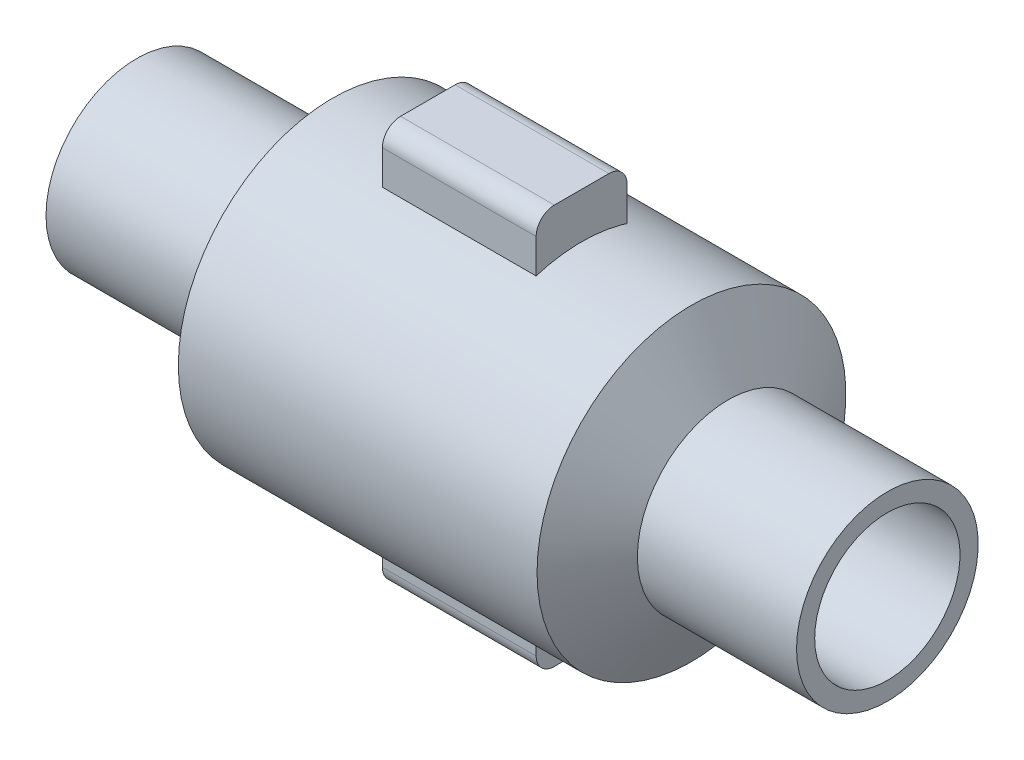
ISO-10303-21;
HEADER;
FILE_DESCRIPTION(('STEP AP214'),'2;1');
FILE_NAME('part.step','',(''),(''),'','','');
FILE_SCHEMA(('AUTOMOTIVE_DESIGN { 1 0 10303 214 1 1 1 1 }'));
ENDSEC;
DATA;
#1=APPLICATION_CONTEXT('core data for automotive mechanical design processes');
#2=APPLICATION_PROTOCOL_DEFINITION('international standard','automotive_design',2000,#1);
#3=PRODUCT_CONTEXT('',#1,'mechanical');
#4=PRODUCT('Part','Part','',(#3));
#5=PRODUCT_RELATED_PRODUCT_CATEGORY('part','',(#4));
#6=PRODUCT_DEFINITION_FORMATION('','',#4);
#7=PRODUCT_DEFINITION_CONTEXT('part definition',#1,'design');
#8=PRODUCT_DEFINITION('design','',#6,#7);
#9=PRODUCT_DEFINITION_SHAPE('','',#8);
#10=(LENGTH_UNIT() NAMED_UNIT(*) SI_UNIT(.MILLI.,.METRE.));
#11=(NAMED_UNIT(*) PLANE_ANGLE_UNIT() SI_UNIT($,.RADIAN.));
#12=(NAMED_UNIT(*) SI_UNIT($,.STERADIAN.) SOLID_ANGLE_UNIT());
#13=UNCERTAINTY_MEASURE_WITH_UNIT(LENGTH_MEASURE(1.E-05),#10,'distance_accuracy_value','');
#14=(GEOMETRIC_REPRESENTATION_CONTEXT(3) GLOBAL_UNCERTAINTY_ASSIGNED_CONTEXT((#13)) GLOBAL_UNIT_ASSIGNED_CONTEXT((#10,
#11,#12)) REPRESENTATION_CONTEXT('',''));
#15=CARTESIAN_POINT('',(0.,0.,0.));
#16=DIRECTION('',(0.,0.,1.));
#17=DIRECTION('',(1.,0.,0.));
#18=AXIS2_PLACEMENT_3D('',#15,#16,#17);
#19=CARTESIAN_POINT('',(979.402861939771,-299.999999958007,-100.093269930531));
#20=DIRECTION('',(1.,0.,0.));
#21=DIRECTION('',(0.,1.,0.));
#22=AXIS2_PLACEMENT_3D('',#19,#20,#21);
#23=PLANE('',#22);
#24=DIRECTION('',(0.,-1.,0.));
#25=VECTOR('',#24,1.);
#26=CARTESIAN_POINT('',(979.402861939771,-299.999999958007,100.093269930531));
#27=LINE('',#26,#25);
#28=CARTESIAN_POINT('',(979.402861939771,-299.999999958007,100.093269930531));
#29=VERTEX_POINT('',#28);
#30=CARTESIAN_POINT('',(979.402861939771,-399.999999856007,100.093269930531));
#31=VERTEX_POINT('',#30);
#32=EDGE_CURVE('E97',#29,#31,#27,.T.);
#33=ORIENTED_EDGE('',*,*,#32,.T.);
#34=CARTESIAN_POINT('',(979.402861939771,-399.999999856007,60.0932699305311));
#35=DIRECTION('',(1.,0.,0.));
#36=DIRECTION('',(0.,1.,0.));
#37=AXIS2_PLACEMENT_3D('',#34,#35,#36);
#38=CIRCLE('',#37,40.);
#39=CARTESIAN_POINT('',(979.40286193977,-439.999999856007,60.0932699305311));
#40=VERTEX_POINT('',#39);
#41=EDGE_CURVE('E54',#31,#40,#38,.T.);
#42=ORIENTED_EDGE('',*,*,#41,.T.);
#43=DIRECTION('',(0.,0.,1.));
#44=VECTOR('',#43,1.);
#45=CARTESIAN_POINT('',(979.40286193977,-439.999999856007,-100.093269930531));
#46=LINE('',#45,#44);
#47=CARTESIAN_POINT('',(979.40286193977,-439.999999856007,-60.0932699305311));
#48=VERTEX_POINT('',#47);
#49=EDGE_CURVE('E120',#48,#40,#46,.T.);
#50=ORIENTED_EDGE('',*,*,#49,.F.);
#51=CARTESIAN_POINT('',(979.402861939771,-399.999999856007,-60.0932699305311));
#52=DIRECTION('',(1.,0.,0.));
#53=DIRECTION('',(0.,1.,0.));
#54=AXIS2_PLACEMENT_3D('',#51,#52,#53);
#55=CIRCLE('',#54,40.);
#56=CARTESIAN_POINT('',(979.402861939771,-399.999999856007,-100.093269930531));
#57=VERTEX_POINT('',#56);
#58=EDGE_CURVE('E61',#48,#57,#55,.T.);
#59=ORIENTED_EDGE('',*,*,#58,.T.);
#60=DIRECTION('',(0.,-1.,0.));
#61=VECTOR('',#60,1.);
#62=CARTESIAN_POINT('',(979.402861939771,-299.999999958007,-100.093269930531));
#63=LINE('',#62,#61);
#64=CARTESIAN_POINT('',(979.402861939771,-299.999999958007,-100.093269930531));
#65=VERTEX_POINT('',#64);
#66=EDGE_CURVE('E116',#65,#57,#63,.T.);
#67=ORIENTED_EDGE('',*,*,#66,.F.);
#68=DIRECTION('',(0.,0.,1.));
#69=VECTOR('',#68,1.);
#70=CARTESIAN_POINT('',(979.402861939771,-299.999999958007,-100.093269930531));
#71=LINE('',#70,#69);
#72=EDGE_CURVE('E111',#65,#29,#71,.T.);
#73=ORIENTED_EDGE('',*,*,#72,.T.);
#74=EDGE_LOOP('',(#33,#42,#50,#59,#67,#73));
#75=FACE_BOUND('',#74,.T.);
#76=ADVANCED_FACE('F46',(#75),#23,.T.);
#77=CARTESIAN_POINT('',(979.402861939771,-299.999999958007,-100.093269930531));
#78=DIRECTION('',(0.,0.,-1.));
#79=DIRECTION('',(-1.,0.,0.));
#80=AXIS2_PLACEMENT_3D('',#77,#78,#79);
#81=PLANE('',#80);
#82=ORIENTED_EDGE('',*,*,#66,.T.);
#83=DIRECTION('',(1.,0.,0.));
#84=VECTOR('',#83,1.);
#85=CARTESIAN_POINT('',(979.402861939771,-399.999999856007,-100.093269930531));
#86=LINE('',#85,#84);
#87=CARTESIAN_POINT('',(640.852095998261,-399.999999856004,-100.093269930531));
#88=VERTEX_POINT('',#87);
#89=EDGE_CURVE('E12',#57,#88,#86,.F.);
#90=ORIENTED_EDGE('',*,*,#89,.T.);
#91=DIRECTION('',(0.,-1.,0.));
#92=VECTOR('',#91,1.);
#93=CARTESIAN_POINT('',(640.852095998262,-299.999999958004,-100.093269930531));
#94=LINE('',#93,#92);
#95=CARTESIAN_POINT('',(640.852095998262,-299.999999958004,-100.093269930531));
#96=VERTEX_POINT('',#95);
#97=EDGE_CURVE('E128',#96,#88,#94,.T.);
#98=ORIENTED_EDGE('',*,*,#97,.F.);
#99=DIRECTION('',(1.,0.,0.));
#100=VECTOR('',#99,1.);
#101=CARTESIAN_POINT('',(979.402861939771,-299.999999958007,-100.093269930531));
#102=LINE('',#101,#100);
#103=EDGE_CURVE('E104',#96,#65,#102,.T.);
#104=ORIENTED_EDGE('',*,*,#103,.T.);
#105=EDGE_LOOP('',(#82,#90,#98,#104));
#106=FACE_BOUND('',#105,.T.);
#107=ADVANCED_FACE('F156',(#106),#81,.T.);
#108=CARTESIAN_POINT('',(640.852095998262,-299.999999958004,-100.093269930531));
#109=DIRECTION('',(-1.,0.,0.));
#110=DIRECTION('',(0.,-1.,0.));
#111=AXIS2_PLACEMENT_3D('',#108,#109,#110);
#112=PLANE('',#111);
#113=DIRECTION('',(0.,0.,-1.));
#114=VECTOR('',#113,1.);
#115=CARTESIAN_POINT('',(640.852095998261,-439.999999856004,-100.093269930531));
#116=LINE('',#115,#114);
#117=CARTESIAN_POINT('',(640.852095998261,-439.999999856004,60.0932699305311));
#118=VERTEX_POINT('',#117);
#119=CARTESIAN_POINT('',(640.852095998261,-439.999999856004,-60.0932699305311));
#120=VERTEX_POINT('',#119);
#121=EDGE_CURVE('E117',#118,#120,#116,.T.);
#122=ORIENTED_EDGE('',*,*,#121,.F.);
#123=CARTESIAN_POINT('',(640.852095998261,-399.999999856004,60.0932699305311));
#124=DIRECTION('',(-1.,0.,0.));
#125=DIRECTION('',(0.,-1.,0.));
#126=AXIS2_PLACEMENT_3D('',#123,#124,#125);
#127=CIRCLE('',#126,40.);
#128=CARTESIAN_POINT('',(640.852095998261,-399.999999856004,100.093269930531));
#129=VERTEX_POINT('',#128);
#130=EDGE_CURVE('E139',#118,#129,#127,.T.);
#131=ORIENTED_EDGE('',*,*,#130,.T.);
#132=DIRECTION('',(0.,-1.,0.));
#133=VECTOR('',#132,1.);
#134=CARTESIAN_POINT('',(640.852095998262,-299.999999958004,100.093269930531));
#135=LINE('',#134,#133);
#136=CARTESIAN_POINT('',(640.852095998262,-299.999999958004,100.093269930531));
#137=VERTEX_POINT('',#136);
#138=EDGE_CURVE('E103',#137,#129,#135,.T.);
#139=ORIENTED_EDGE('',*,*,#138,.F.);
#140=DIRECTION('',(0.,0.,-1.));
#141=VECTOR('',#140,1.);
#142=CARTESIAN_POINT('',(640.852095998262,-299.999999958004,-100.093269930531));
#143=LINE('',#142,#141);
#144=EDGE_CURVE('E114',#137,#96,#143,.T.);
#145=ORIENTED_EDGE('',*,*,#144,.T.);
#146=ORIENTED_EDGE('',*,*,#97,.T.);
#147=CARTESIAN_POINT('',(640.852095998261,-399.999999856004,-60.0932699305311));
#148=DIRECTION('',(-1.,0.,0.));
#149=DIRECTION('',(0.,-1.,0.));
#150=AXIS2_PLACEMENT_3D('',#147,#148,#149);
#151=CIRCLE('',#150,40.);
#152=EDGE_CURVE('E137',#88,#120,#151,.T.);
#153=ORIENTED_EDGE('',*,*,#152,.T.);
#154=EDGE_LOOP('',(#122,#131,#139,#145,#146,#153));
#155=FACE_BOUND('',#154,.T.);
#156=ADVANCED_FACE('F151',(#155),#112,.T.);
#157=CARTESIAN_POINT('',(979.402861939771,-299.999999958007,100.093269930531));
#158=DIRECTION('',(0.,0.,1.));
#159=DIRECTION('',(1.,0.,0.));
#160=AXIS2_PLACEMENT_3D('',#157,#158,#159);
#161=PLANE('',#160);
#162=ORIENTED_EDGE('',*,*,#138,.T.);
#163=DIRECTION('',(-1.,0.,0.));
#164=VECTOR('',#163,1.);
#165=CARTESIAN_POINT('',(979.402861939771,-399.999999856007,100.093269930531));
#166=LINE('',#165,#164);
#167=EDGE_CURVE('E69',#129,#31,#166,.F.);
#168=ORIENTED_EDGE('',*,*,#167,.T.);
#169=ORIENTED_EDGE('',*,*,#32,.F.);
#170=DIRECTION('',(-1.,0.,0.));
#171=VECTOR('',#170,1.);
#172=CARTESIAN_POINT('',(979.402861939771,-299.999999958007,100.093269930531));
#173=LINE('',#172,#171);
#174=EDGE_CURVE('E100',#29,#137,#173,.T.);
#175=ORIENTED_EDGE('',*,*,#174,.T.);
#176=EDGE_LOOP('',(#162,#168,#169,#175));
#177=FACE_BOUND('',#176,.T.);
#178=ADVANCED_FACE('F99',(#177),#161,.T.);
#179=CARTESIAN_POINT('',(-2.06213015947566E-12,-299.999999958,0.));
#180=DIRECTION('',(0.,-1.,0.));
#181=DIRECTION('',(1.,0.,0.));
#182=AXIS2_PLACEMENT_3D('',#179,#180,#181);
#183=PLANE('',#182);
#184=ORIENTED_EDGE('',*,*,#72,.F.);
#185=ORIENTED_EDGE('',*,*,#103,.F.);
#186=ORIENTED_EDGE('',*,*,#144,.F.);
#187=ORIENTED_EDGE('',*,*,#174,.F.);
#188=EDGE_LOOP('',(#184,#185,#186,#187));
#189=FACE_BOUND('',#188,.T.);
#190=ADVANCED_FACE('F109',(#189),#183,.F.);
#191=CARTESIAN_POINT('',(-3.03974493363948E-12,-439.999999856,0.));
#192=DIRECTION('',(0.,-1.,0.));
#193=DIRECTION('',(1.,0.,0.));
#194=AXIS2_PLACEMENT_3D('',#191,#192,#193);
#195=PLANE('',#194);
#196=ORIENTED_EDGE('',*,*,#49,.T.);
#197=DIRECTION('',(-1.,0.,0.));
#198=VECTOR('',#197,1.);
#199=CARTESIAN_POINT('',(-3.03974493363948E-12,-439.999999856,60.0932699305311));
#200=LINE('',#199,#198);
#201=EDGE_CURVE('E134',#40,#118,#200,.T.);
#202=ORIENTED_EDGE('',*,*,#201,.T.);
#203=ORIENTED_EDGE('',*,*,#121,.T.);
#204=DIRECTION('',(1.,0.,0.));
#205=VECTOR('',#204,1.);
#206=CARTESIAN_POINT('',(-3.03974493363948E-12,-439.999999856,-60.0932699305311));
#207=LINE('',#206,#205);
#208=EDGE_CURVE('E127',#120,#48,#207,.T.);
#209=ORIENTED_EDGE('',*,*,#208,.T.);
#210=EDGE_LOOP('',(#196,#202,#203,#209));
#211=FACE_BOUND('',#210,.T.);
#212=ADVANCED_FACE('F146',(#211),#195,.T.);
#213=CARTESIAN_POINT('',(-2.76428038459567E-12,-399.999999856,60.0932699305311));
#214=DIRECTION('',(-1.,0.,0.));
#215=DIRECTION('',(0.,-1.,0.));
#216=AXIS2_PLACEMENT_3D('',#213,#214,#215);
#217=CYLINDRICAL_SURFACE('',#216,40.);
#218=ORIENTED_EDGE('',*,*,#41,.F.);
#219=ORIENTED_EDGE('',*,*,#167,.F.);
#220=ORIENTED_EDGE('',*,*,#130,.F.);
#221=ORIENTED_EDGE('',*,*,#201,.F.);
#222=EDGE_LOOP('',(#218,#219,#220,#221));
#223=FACE_BOUND('',#222,.T.);
#224=ADVANCED_FACE('F149',(#223),#217,.T.);
#225=CARTESIAN_POINT('',(-2.76428038459567E-12,-399.999999856,-60.0932699305311));
#226=DIRECTION('',(1.,0.,0.));
#227=DIRECTION('',(0.,1.,0.));
#228=AXIS2_PLACEMENT_3D('',#225,#226,#227);
#229=CYLINDRICAL_SURFACE('',#228,40.);
#230=ORIENTED_EDGE('',*,*,#152,.F.);
#231=ORIENTED_EDGE('',*,*,#89,.F.);
#232=ORIENTED_EDGE('',*,*,#58,.F.);
#233=ORIENTED_EDGE('',*,*,#208,.F.);
#234=EDGE_LOOP('',(#230,#231,#232,#233));
#235=FACE_BOUND('',#234,.T.);
#236=ADVANCED_FACE('F48',(#235),#229,.T.);
#237=CLOSED_SHELL('',(#76,#107,#156,#178,#190,#212,#224,#236));
#238=MANIFOLD_SOLID_BREP('B2',#237);
#239=CARTESIAN_POINT('',(979.402861939775,299.999999958,-100.093269930531));
#240=DIRECTION('',(1.,0.,0.));
#241=DIRECTION('',(0.,0.,-1.));
#242=AXIS2_PLACEMENT_3D('',#239,#240,#241);
#243=PLANE('',#242);
#244=DIRECTION('',(0.,1.,0.));
#245=VECTOR('',#244,1.);
#246=CARTESIAN_POINT('',(979.402861939775,299.999999958,-100.093269930531));
#247=LINE('',#246,#245);
#248=CARTESIAN_POINT('',(979.402861939775,299.999999958,-100.093269930531));
#249=VERTEX_POINT('',#248);
#250=CARTESIAN_POINT('',(979.402861939775,399.999999958,-100.093269930531));
#251=VERTEX_POINT('',#250);
#252=EDGE_CURVE('E282',#249,#251,#247,.T.);
#253=ORIENTED_EDGE('',*,*,#252,.T.);
#254=CARTESIAN_POINT('',(979.402861939776,399.999999958,-60.0932699305311));
#255=DIRECTION('',(1.,0.,0.));
#256=DIRECTION('',(0.,0.,-1.));
#257=AXIS2_PLACEMENT_3D('',#254,#255,#256);
#258=CIRCLE('',#257,40.);
#259=CARTESIAN_POINT('',(979.402861939776,439.999999958,-60.0932699305311));
#260=VERTEX_POINT('',#259);
#261=EDGE_CURVE('E239',#251,#260,#258,.T.);
#262=ORIENTED_EDGE('',*,*,#261,.T.);
#263=DIRECTION('',(0.,0.,-1.));
#264=VECTOR('',#263,1.);
#265=CARTESIAN_POINT('',(979.402861939775,439.999999958,-100.093269930531));
#266=LINE('',#265,#264);
#267=CARTESIAN_POINT('',(979.402861939776,439.999999958,60.0932699305311));
#268=VERTEX_POINT('',#267);
#269=EDGE_CURVE('E305',#268,#260,#266,.T.);
#270=ORIENTED_EDGE('',*,*,#269,.F.);
#271=CARTESIAN_POINT('',(979.402861939776,399.999999958,60.0932699305311));
#272=DIRECTION('',(1.,0.,0.));
#273=DIRECTION('',(0.,0.,-1.));
#274=AXIS2_PLACEMENT_3D('',#271,#272,#273);
#275=CIRCLE('',#274,40.);
#276=CARTESIAN_POINT('',(979.402861939776,399.999999958,100.093269930531));
#277=VERTEX_POINT('',#276);
#278=EDGE_CURVE('E246',#268,#277,#275,.T.);
#279=ORIENTED_EDGE('',*,*,#278,.T.);
#280=DIRECTION('',(0.,1.,0.));
#281=VECTOR('',#280,1.);
#282=CARTESIAN_POINT('',(979.402861939776,299.999999958,100.093269930531));
#283=LINE('',#282,#281);
#284=CARTESIAN_POINT('',(979.402861939776,299.999999958,100.093269930531));
#285=VERTEX_POINT('',#284);
#286=EDGE_CURVE('E301',#285,#277,#283,.T.);
#287=ORIENTED_EDGE('',*,*,#286,.F.);
#288=DIRECTION('',(0.,0.,-1.));
#289=VECTOR('',#288,1.);
#290=CARTESIAN_POINT('',(979.402861939775,299.999999958,-100.093269930531));
#291=LINE('',#290,#289);
#292=EDGE_CURVE('E296',#285,#249,#291,.T.);
#293=ORIENTED_EDGE('',*,*,#292,.T.);
#294=EDGE_LOOP('',(#253,#262,#270,#279,#287,#293));
#295=FACE_BOUND('',#294,.T.);
#296=ADVANCED_FACE('F231',(#295),#243,.T.);
#297=CARTESIAN_POINT('',(640.852095998266,299.999999958,100.093269930531));
#298=DIRECTION('',(0.,0.,1.));
#299=DIRECTION('',(1.,0.,0.));
#300=AXIS2_PLACEMENT_3D('',#297,#298,#299);
#301=PLANE('',#300);
#302=ORIENTED_EDGE('',*,*,#286,.T.);
#303=DIRECTION('',(1.,0.,0.));
#304=VECTOR('',#303,1.);
#305=CARTESIAN_POINT('',(640.852095998266,399.999999958,100.093269930531));
#306=LINE('',#305,#304);
#307=CARTESIAN_POINT('',(640.852095998266,399.999999958,100.093269930531));
#308=VERTEX_POINT('',#307);
#309=EDGE_CURVE('E44',#277,#308,#306,.F.);
#310=ORIENTED_EDGE('',*,*,#309,.T.);
#311=DIRECTION('',(0.,1.,0.));
#312=VECTOR('',#311,1.);
#313=CARTESIAN_POINT('',(640.852095998266,299.999999958,100.093269930531));
#314=LINE('',#313,#312);
#315=CARTESIAN_POINT('',(640.852095998266,299.999999958,100.093269930531));
#316=VERTEX_POINT('',#315);
#317=EDGE_CURVE('E313',#316,#308,#314,.T.);
#318=ORIENTED_EDGE('',*,*,#317,.F.);
#319=DIRECTION('',(1.,0.,0.));
#320=VECTOR('',#319,1.);
#321=CARTESIAN_POINT('',(640.852095998266,299.999999958,100.093269930531));
#322=LINE('',#321,#320);
#323=EDGE_CURVE('E289',#316,#285,#322,.T.);
#324=ORIENTED_EDGE('',*,*,#323,.T.);
#325=EDGE_LOOP('',(#302,#310,#318,#324));
#326=FACE_BOUND('',#325,.T.);
#327=ADVANCED_FACE('F341',(#326),#301,.T.);
#328=CARTESIAN_POINT('',(640.852095998265,299.999999958,-100.093269930531));
#329=DIRECTION('',(-1.,0.,0.));
#330=DIRECTION('',(0.,0.,1.));
#331=AXIS2_PLACEMENT_3D('',#328,#329,#330);
#332=PLANE('',#331);
#333=DIRECTION('',(0.,0.,1.));
#334=VECTOR('',#333,1.);
#335=CARTESIAN_POINT('',(640.852095998265,439.999999958,-100.093269930531));
#336=LINE('',#335,#334);
#337=CARTESIAN_POINT('',(640.852095998265,439.999999958,-60.0932699305311));
#338=VERTEX_POINT('',#337);
#339=CARTESIAN_POINT('',(640.852095998266,439.999999958,60.0932699305311));
#340=VERTEX_POINT('',#339);
#341=EDGE_CURVE('E302',#338,#340,#336,.T.);
#342=ORIENTED_EDGE('',*,*,#341,.F.);
#343=CARTESIAN_POINT('',(640.852095998265,399.999999958,-60.0932699305311));
#344=DIRECTION('',(-1.,0.,0.));
#345=DIRECTION('',(0.,0.,1.));
#346=AXIS2_PLACEMENT_3D('',#343,#344,#345);
#347=CIRCLE('',#346,40.);
#348=CARTESIAN_POINT('',(640.852095998265,399.999999958,-100.093269930531));
#349=VERTEX_POINT('',#348);
#350=EDGE_CURVE('E324',#338,#349,#347,.T.);
#351=ORIENTED_EDGE('',*,*,#350,.T.);
#352=DIRECTION('',(0.,1.,0.));
#353=VECTOR('',#352,1.);
#354=CARTESIAN_POINT('',(640.852095998265,299.999999958,-100.093269930531));
#355=LINE('',#354,#353);
#356=CARTESIAN_POINT('',(640.852095998265,299.999999958,-100.093269930531));
#357=VERTEX_POINT('',#356);
#358=EDGE_CURVE('E288',#357,#349,#355,.T.);
#359=ORIENTED_EDGE('',*,*,#358,.F.);
#360=DIRECTION('',(0.,0.,1.));
#361=VECTOR('',#360,1.);
#362=CARTESIAN_POINT('',(640.852095998265,299.999999958,-100.093269930531));
#363=LINE('',#362,#361);
#364=EDGE_CURVE('E299',#357,#316,#363,.T.);
#365=ORIENTED_EDGE('',*,*,#364,.T.);
#366=ORIENTED_EDGE('',*,*,#317,.T.);
#367=CARTESIAN_POINT('',(640.852095998266,399.999999958,60.0932699305311));
#368=DIRECTION('',(-1.,0.,0.));
#369=DIRECTION('',(0.,0.,1.));
#370=AXIS2_PLACEMENT_3D('',#367,#368,#369);
#371=CIRCLE('',#370,40.);
#372=EDGE_CURVE('E322',#308,#340,#371,.T.);
#373=ORIENTED_EDGE('',*,*,#372,.T.);
#374=EDGE_LOOP('',(#342,#351,#359,#365,#366,#373));
#375=FACE_BOUND('',#374,.T.);
#376=ADVANCED_FACE('F336',(#375),#332,.T.);
#377=CARTESIAN_POINT('',(640.852095998265,299.999999958,-100.093269930531));
#378=DIRECTION('',(0.,0.,-1.));
#379=DIRECTION('',(-1.,0.,0.));
#380=AXIS2_PLACEMENT_3D('',#377,#378,#379);
#381=PLANE('',#380);
#382=ORIENTED_EDGE('',*,*,#358,.T.);
#383=DIRECTION('',(-1.,0.,0.));
#384=VECTOR('',#383,1.);
#385=CARTESIAN_POINT('',(640.852095998265,399.999999958,-100.093269930531));
#386=LINE('',#385,#384);
#387=EDGE_CURVE('E254',#349,#251,#386,.F.);
#388=ORIENTED_EDGE('',*,*,#387,.T.);
#389=ORIENTED_EDGE('',*,*,#252,.F.);
#390=DIRECTION('',(-1.,0.,0.));
#391=VECTOR('',#390,1.);
#392=CARTESIAN_POINT('',(640.852095998265,299.999999958,-100.093269930531));
#393=LINE('',#392,#391);
#394=EDGE_CURVE('E285',#249,#357,#393,.T.);
#395=ORIENTED_EDGE('',*,*,#394,.T.);
#396=EDGE_LOOP('',(#382,#388,#389,#395));
#397=FACE_BOUND('',#396,.T.);
#398=ADVANCED_FACE('F284',(#397),#381,.T.);
#399=CARTESIAN_POINT('',(0.,299.999999958,0.));
#400=DIRECTION('',(0.,1.,0.));
#401=DIRECTION('',(0.,0.,1.));
#402=AXIS2_PLACEMENT_3D('',#399,#400,#401);
#403=PLANE('',#402);
#404=ORIENTED_EDGE('',*,*,#292,.F.);
#405=ORIENTED_EDGE('',*,*,#323,.F.);
#406=ORIENTED_EDGE('',*,*,#364,.F.);
#407=ORIENTED_EDGE('',*,*,#394,.F.);
#408=EDGE_LOOP('',(#404,#405,#406,#407));
#409=FACE_BOUND('',#408,.T.);
#410=ADVANCED_FACE('F294',(#409),#403,.F.);
#411=CARTESIAN_POINT('',(0.,439.999999958,0.));
#412=DIRECTION('',(0.,1.,0.));
#413=DIRECTION('',(0.,0.,1.));
#414=AXIS2_PLACEMENT_3D('',#411,#412,#413);
#415=PLANE('',#414);
#416=ORIENTED_EDGE('',*,*,#269,.T.);
#417=DIRECTION('',(-1.,0.,0.));
#418=VECTOR('',#417,1.);
#419=CARTESIAN_POINT('',(0.,439.999999958,-60.0932699305311));
#420=LINE('',#419,#418);
#421=EDGE_CURVE('E319',#260,#338,#420,.T.);
#422=ORIENTED_EDGE('',*,*,#421,.T.);
#423=ORIENTED_EDGE('',*,*,#341,.T.);
#424=DIRECTION('',(1.,0.,0.));
#425=VECTOR('',#424,1.);
#426=CARTESIAN_POINT('',(0.,439.999999958,60.0932699305311));
#427=LINE('',#426,#425);
#428=EDGE_CURVE('E312',#340,#268,#427,.T.);
#429=ORIENTED_EDGE('',*,*,#428,.T.);
#430=EDGE_LOOP('',(#416,#422,#423,#429));
#431=FACE_BOUND('',#430,.T.);
#432=ADVANCED_FACE('F331',(#431),#415,.T.);
#433=CARTESIAN_POINT('',(0.,399.999999958,-60.0932699305311));
#434=DIRECTION('',(-1.,0.,0.));
#435=DIRECTION('',(0.,0.,1.));
#436=AXIS2_PLACEMENT_3D('',#433,#434,#435);
#437=CYLINDRICAL_SURFACE('',#436,40.);
#438=ORIENTED_EDGE('',*,*,#261,.F.);
#439=ORIENTED_EDGE('',*,*,#387,.F.);
#440=ORIENTED_EDGE('',*,*,#350,.F.);
#441=ORIENTED_EDGE('',*,*,#421,.F.);
#442=EDGE_LOOP('',(#438,#439,#440,#441));
#443=FACE_BOUND('',#442,.T.);
#444=ADVANCED_FACE('F334',(#443),#437,.T.);
#445=CARTESIAN_POINT('',(0.,399.999999958,60.0932699305311));
#446=DIRECTION('',(1.,0.,0.));
#447=DIRECTION('',(0.,0.,-1.));
#448=AXIS2_PLACEMENT_3D('',#445,#446,#447);
#449=CYLINDRICAL_SURFACE('',#448,40.);
#450=ORIENTED_EDGE('',*,*,#372,.F.);
#451=ORIENTED_EDGE('',*,*,#309,.F.);
#452=ORIENTED_EDGE('',*,*,#278,.F.);
#453=ORIENTED_EDGE('',*,*,#428,.F.);
#454=EDGE_LOOP('',(#450,#451,#452,#453));
#455=FACE_BOUND('',#454,.T.);
#456=ADVANCED_FACE('F233',(#455),#449,.T.);
#457=CLOSED_SHELL('',(#296,#327,#376,#398,#410,#432,#444,#456));
#458=MANIFOLD_SOLID_BREP('B6',#457);
#459=CARTESIAN_POINT('',(0.,159.99999878,0.));
#460=DIRECTION('',(-1.,0.,0.));
#461=DIRECTION('',(0.,0.,1.));
#462=AXIS2_PLACEMENT_3D('',#459,#460,#461);
#463=PLANE('',#462);
#464=CARTESIAN_POINT('',(0.,0.,0.));
#465=DIRECTION('',(-1.,0.,0.));
#466=DIRECTION('',(0.,0.,1.));
#467=AXIS2_PLACEMENT_3D('',#464,#465,#466);
#468=CIRCLE('',#467,199.99999878);
#469=CARTESIAN_POINT('',(0.,0.,199.99999878));
#470=VERTEX_POINT('',#469);
#471=EDGE_CURVE('E413',#470,#470,#468,.T.);
#472=ORIENTED_EDGE('',*,*,#471,.T.);
#473=EDGE_LOOP('',(#472));
#474=FACE_BOUND('',#473,.T.);
#475=CARTESIAN_POINT('',(0.,0.,0.));
#476=DIRECTION('',(-1.,0.,0.));
#477=DIRECTION('',(0.,0.,1.));
#478=AXIS2_PLACEMENT_3D('',#475,#476,#477);
#479=CIRCLE('',#478,159.99999878);
#480=CARTESIAN_POINT('',(0.,0.,159.99999878));
#481=VERTEX_POINT('',#480);
#482=EDGE_CURVE('E230',#481,#481,#479,.T.);
#483=ORIENTED_EDGE('',*,*,#482,.F.);
#484=EDGE_LOOP('',(#483));
#485=FACE_BOUND('',#484,.T.);
#486=ADVANCED_FACE('F407',(#474,#485),#463,.T.);
#487=CARTESIAN_POINT('',(0.,0.,0.));
#488=DIRECTION('',(-1.,0.,0.));
#489=DIRECTION('',(0.,0.,1.));
#490=AXIS2_PLACEMENT_3D('',#487,#488,#489);
#491=CYLINDRICAL_SURFACE('',#490,199.99999878);
#492=CARTESIAN_POINT('',(350.52,0.,0.));
#493=DIRECTION('',(-1.,0.,0.));
#494=DIRECTION('',(0.,0.,1.));
#495=AXIS2_PLACEMENT_3D('',#492,#493,#494);
#496=CIRCLE('',#495,199.99999878);
#497=CARTESIAN_POINT('',(350.52,0.,199.99999878));
#498=VERTEX_POINT('',#497);
#499=EDGE_CURVE('E417',#498,#498,#496,.T.);
#500=ORIENTED_EDGE('',*,*,#499,.T.);
#501=EDGE_LOOP('',(#500));
#502=FACE_BOUND('',#501,.T.);
#503=ORIENTED_EDGE('',*,*,#471,.F.);
#504=EDGE_LOOP('',(#503));
#505=FACE_BOUND('',#504,.T.);
#506=ADVANCED_FACE('F463',(#502,#505),#491,.T.);
#507=CARTESIAN_POINT('',(350.52,0.,0.));
#508=DIRECTION('',(1.,0.,0.));
#509=DIRECTION('',(0.,0.,-1.));
#510=AXIS2_PLACEMENT_3D('',#507,#508,#509);
#511=CONICAL_SURFACE('',#510,199.99999878,1.0471975511966);
#512=CARTESIAN_POINT('',(431.349037340137,0.,0.));
#513=DIRECTION('',(-1.,0.,0.));
#514=DIRECTION('',(0.,0.,1.));
#515=AXIS2_PLACEMENT_3D('',#512,#513,#514);
#516=CIRCLE('',#515,339.99999818);
#517=CARTESIAN_POINT('',(431.349037340137,0.,339.99999818));
#518=VERTEX_POINT('',#517);
#519=EDGE_CURVE('E421',#518,#518,#516,.T.);
#520=ORIENTED_EDGE('',*,*,#519,.T.);
#521=EDGE_LOOP('',(#520));
#522=FACE_BOUND('',#521,.T.);
#523=ORIENTED_EDGE('',*,*,#499,.F.);
#524=EDGE_LOOP('',(#523));
#525=FACE_BOUND('',#524,.T.);
#526=ADVANCED_FACE('F467',(#522,#525),#511,.T.);
#527=CARTESIAN_POINT('',(0.,0.,0.));
#528=DIRECTION('',(-1.,0.,0.));
#529=DIRECTION('',(0.,0.,1.));
#530=AXIS2_PLACEMENT_3D('',#527,#528,#529);
#531=CYLINDRICAL_SURFACE('',#530,339.99999818);
#532=CARTESIAN_POINT('',(1221.28903734014,0.,0.));
#533=DIRECTION('',(-1.,0.,0.));
#534=DIRECTION('',(0.,0.,1.));
#535=AXIS2_PLACEMENT_3D('',#532,#533,#534);
#536=CIRCLE('',#535,339.99999818);
#537=CARTESIAN_POINT('',(1221.28903734014,0.,339.99999818));
#538=VERTEX_POINT('',#537);
#539=EDGE_CURVE('E426',#538,#538,#536,.T.);
#540=ORIENTED_EDGE('',*,*,#539,.T.);
#541=EDGE_LOOP('',(#540));
#542=FACE_BOUND('',#541,.T.);
#543=ORIENTED_EDGE('',*,*,#519,.F.);
#544=EDGE_LOOP('',(#543));
#545=FACE_BOUND('',#544,.T.);
#546=ADVANCED_FACE('F473',(#542,#545),#531,.T.);
#547=CARTESIAN_POINT('',(1221.28903734014,0.,0.));
#548=DIRECTION('',(-1.,0.,0.));
#549=DIRECTION('',(0.,0.,1.));
#550=AXIS2_PLACEMENT_3D('',#547,#548,#549);
#551=CONICAL_SURFACE('',#550,339.99999818,1.0471975511966);
#552=CARTESIAN_POINT('',(1302.11807468027,0.,0.));
#553=DIRECTION('',(-1.,0.,0.));
#554=DIRECTION('',(0.,0.,1.));
#555=AXIS2_PLACEMENT_3D('',#552,#553,#554);
#556=CIRCLE('',#555,199.99999878);
#557=CARTESIAN_POINT('',(1302.11807468027,0.,199.99999878));
#558=VERTEX_POINT('',#557);
#559=EDGE_CURVE('E429',#558,#558,#556,.T.);
#560=ORIENTED_EDGE('',*,*,#559,.T.);
#561=EDGE_LOOP('',(#560));
#562=FACE_BOUND('',#561,.T.);
#563=ORIENTED_EDGE('',*,*,#539,.F.);
#564=EDGE_LOOP('',(#563));
#565=FACE_BOUND('',#564,.T.);
#566=ADVANCED_FACE('F480',(#562,#565),#551,.T.);
#567=CARTESIAN_POINT('',(0.,0.,0.));
#568=DIRECTION('',(-1.,0.,0.));
#569=DIRECTION('',(0.,0.,1.));
#570=AXIS2_PLACEMENT_3D('',#567,#568,#569);
#571=CYLINDRICAL_SURFACE('',#570,199.99999878);
#572=CARTESIAN_POINT('',(1652.63807468027,0.,0.));
#573=DIRECTION('',(-1.,0.,0.));
#574=DIRECTION('',(0.,0.,1.));
#575=AXIS2_PLACEMENT_3D('',#572,#573,#574);
#576=CIRCLE('',#575,199.99999878);
#577=CARTESIAN_POINT('',(1652.63807468027,0.,199.99999878));
#578=VERTEX_POINT('',#577);
#579=EDGE_CURVE('E432',#578,#578,#576,.T.);
#580=ORIENTED_EDGE('',*,*,#579,.T.);
#581=EDGE_LOOP('',(#580));
#582=FACE_BOUND('',#581,.T.);
#583=ORIENTED_EDGE('',*,*,#559,.F.);
#584=EDGE_LOOP('',(#583));
#585=FACE_BOUND('',#584,.T.);
#586=ADVANCED_FACE('F484',(#582,#585),#571,.T.);
#587=CARTESIAN_POINT('',(1652.63807468027,199.99999878,0.));
#588=DIRECTION('',(1.,0.,0.));
#589=DIRECTION('',(0.,0.,-1.));
#590=AXIS2_PLACEMENT_3D('',#587,#588,#589);
#591=PLANE('',#590);
#592=CARTESIAN_POINT('',(1652.63807468027,0.,0.));
#593=DIRECTION('',(-1.,0.,0.));
#594=DIRECTION('',(0.,0.,1.));
#595=AXIS2_PLACEMENT_3D('',#592,#593,#594);
#596=CIRCLE('',#595,159.99999878);
#597=CARTESIAN_POINT('',(1652.63807468027,0.,159.99999878));
#598=VERTEX_POINT('',#597);
#599=EDGE_CURVE('E435',#598,#598,#596,.T.);
#600=ORIENTED_EDGE('',*,*,#599,.T.);
#601=EDGE_LOOP('',(#600));
#602=FACE_BOUND('',#601,.T.);
#603=ORIENTED_EDGE('',*,*,#579,.F.);
#604=EDGE_LOOP('',(#603));
#605=FACE_BOUND('',#604,.T.);
#606=ADVANCED_FACE('F488',(#602,#605),#591,.T.);
#607=CARTESIAN_POINT('',(0.,0.,0.));
#608=DIRECTION('',(-1.,0.,0.));
#609=DIRECTION('',(0.,0.,1.));
#610=AXIS2_PLACEMENT_3D('',#607,#608,#609);
#611=CYLINDRICAL_SURFACE('',#610,159.99999878);
#612=ORIENTED_EDGE('',*,*,#599,.F.);
#613=EDGE_LOOP('',(#612));
#614=FACE_BOUND('',#613,.T.);
#615=CARTESIAN_POINT('',(1302.11807468027,0.,0.));
#616=DIRECTION('',(-1.,0.,0.));
#617=DIRECTION('',(0.,0.,1.));
#618=AXIS2_PLACEMENT_3D('',#615,#616,#617);
#619=CIRCLE('',#618,159.99999878);
#620=CARTESIAN_POINT('',(1302.11807468027,0.,159.99999878));
#621=VERTEX_POINT('',#620);
#622=EDGE_CURVE('E438',#621,#621,#619,.T.);
#623=ORIENTED_EDGE('',*,*,#622,.T.);
#624=EDGE_LOOP('',(#623));
#625=FACE_BOUND('',#624,.T.);
#626=ADVANCED_FACE('F492',(#614,#625),#611,.F.);
#627=CARTESIAN_POINT('',(1218.74903734014,0.,0.));
#628=DIRECTION('',(-1.,0.,0.));
#629=DIRECTION('',(0.,0.,1.));
#630=AXIS2_PLACEMENT_3D('',#627,#628,#629);
#631=CONICAL_SURFACE('',#630,299.99999818,1.03369729415885);
#632=ORIENTED_EDGE('',*,*,#622,.F.);
#633=EDGE_LOOP('',(#632));
#634=FACE_BOUND('',#633,.T.);
#635=CARTESIAN_POINT('',(1218.74903734014,0.,0.));
#636=DIRECTION('',(-1.,0.,0.));
#637=DIRECTION('',(0.,0.,1.));
#638=AXIS2_PLACEMENT_3D('',#635,#636,#637);
#639=CIRCLE('',#638,299.99999818);
#640=CARTESIAN_POINT('',(1218.74903734014,0.,299.99999818));
#641=VERTEX_POINT('',#640);
#642=EDGE_CURVE('E441',#641,#641,#639,.T.);
#643=ORIENTED_EDGE('',*,*,#642,.T.);
#644=EDGE_LOOP('',(#643));
#645=FACE_BOUND('',#644,.T.);
#646=ADVANCED_FACE('F496',(#634,#645),#631,.F.);
#647=CARTESIAN_POINT('',(0.,0.,0.));
#648=DIRECTION('',(-1.,0.,0.));
#649=DIRECTION('',(0.,0.,1.));
#650=AXIS2_PLACEMENT_3D('',#647,#648,#649);
#651=CYLINDRICAL_SURFACE('',#650,299.99999818);
#652=ORIENTED_EDGE('',*,*,#642,.F.);
#653=EDGE_LOOP('',(#652));
#654=FACE_BOUND('',#653,.T.);
#655=CARTESIAN_POINT('',(428.809037340137,0.,0.));
#656=DIRECTION('',(-1.,0.,0.));
#657=DIRECTION('',(0.,0.,1.));
#658=AXIS2_PLACEMENT_3D('',#655,#656,#657);
#659=CIRCLE('',#658,299.99999818);
#660=CARTESIAN_POINT('',(428.809037340137,0.,299.99999818));
#661=VERTEX_POINT('',#660);
#662=EDGE_CURVE('E444',#661,#661,#659,.T.);
#663=ORIENTED_EDGE('',*,*,#662,.T.);
#664=EDGE_LOOP('',(#663));
#665=FACE_BOUND('',#664,.T.);
#666=ADVANCED_FACE('F459',(#654,#665),#651,.F.);
#667=CARTESIAN_POINT('',(350.52,0.,0.));
#668=DIRECTION('',(1.,0.,0.));
#669=DIRECTION('',(0.,0.,-1.));
#670=AXIS2_PLACEMENT_3D('',#667,#668,#669);
#671=CONICAL_SURFACE('',#670,159.99999878,1.0609115796581);
#672=ORIENTED_EDGE('',*,*,#662,.F.);
#673=EDGE_LOOP('',(#672));
#674=FACE_BOUND('',#673,.T.);
#675=CARTESIAN_POINT('',(350.52,0.,0.));
#676=DIRECTION('',(-1.,0.,0.));
#677=DIRECTION('',(0.,0.,1.));
#678=AXIS2_PLACEMENT_3D('',#675,#676,#677);
#679=CIRCLE('',#678,159.99999878);
#680=CARTESIAN_POINT('',(350.52,0.,159.99999878));
#681=VERTEX_POINT('',#680);
#682=EDGE_CURVE('E447',#681,#681,#679,.T.);
#683=ORIENTED_EDGE('',*,*,#682,.T.);
#684=EDGE_LOOP('',(#683));
#685=FACE_BOUND('',#684,.T.);
#686=ADVANCED_FACE('F451',(#674,#685),#671,.F.);
#687=CARTESIAN_POINT('',(0.,0.,0.));
#688=DIRECTION('',(-1.,0.,0.));
#689=DIRECTION('',(0.,0.,1.));
#690=AXIS2_PLACEMENT_3D('',#687,#688,#689);
#691=CYLINDRICAL_SURFACE('',#690,159.99999878);
#692=ORIENTED_EDGE('',*,*,#682,.F.);
#693=EDGE_LOOP('',(#692));
#694=FACE_BOUND('',#693,.T.);
#695=ORIENTED_EDGE('',*,*,#482,.T.);
#696=EDGE_LOOP('',(#695));
#697=FACE_BOUND('',#696,.T.);
#698=ADVANCED_FACE('F453',(#694,#697),#691,.F.);
#699=CLOSED_SHELL('',(#486,#506,#526,#546,#566,#586,#606,#626,#646,#666,#686,#698));
#700=MANIFOLD_SOLID_BREP('B38',#699);
#701=ADVANCED_BREP_SHAPE_REPRESENTATION('',(#18,#238,#458,#700),#14);
#702=SHAPE_DEFINITION_REPRESENTATION(#9,#701);
ENDSEC;
END-ISO-10303-21;
